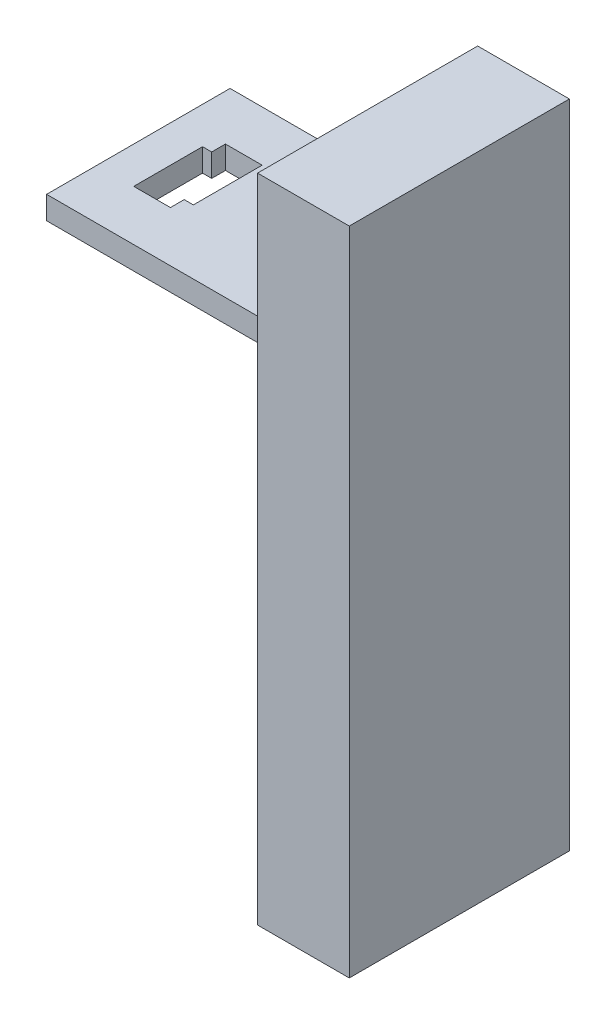
ISO-10303-21;
HEADER;
FILE_DESCRIPTION(('STEP AP214'),'2;1');
FILE_NAME('part.step','',(''),(''),'','','');
FILE_SCHEMA(('AUTOMOTIVE_DESIGN { 1 0 10303 214 1 1 1 1 }'));
ENDSEC;
DATA;
#1=APPLICATION_CONTEXT('core data for automotive mechanical design processes');
#2=APPLICATION_PROTOCOL_DEFINITION('international standard','automotive_design',2000,#1);
#3=PRODUCT_CONTEXT('',#1,'mechanical');
#4=PRODUCT('Part','Part','',(#3));
#5=PRODUCT_RELATED_PRODUCT_CATEGORY('part','',(#4));
#6=PRODUCT_DEFINITION_FORMATION('','',#4);
#7=PRODUCT_DEFINITION_CONTEXT('part definition',#1,'design');
#8=PRODUCT_DEFINITION('design','',#6,#7);
#9=PRODUCT_DEFINITION_SHAPE('','',#8);
#10=(LENGTH_UNIT() NAMED_UNIT(*) SI_UNIT(.MILLI.,.METRE.));
#11=(NAMED_UNIT(*) PLANE_ANGLE_UNIT() SI_UNIT($,.RADIAN.));
#12=(NAMED_UNIT(*) SI_UNIT($,.STERADIAN.) SOLID_ANGLE_UNIT());
#13=UNCERTAINTY_MEASURE_WITH_UNIT(LENGTH_MEASURE(1.E-05),#10,'distance_accuracy_value','');
#14=(GEOMETRIC_REPRESENTATION_CONTEXT(3) GLOBAL_UNCERTAINTY_ASSIGNED_CONTEXT((#13)) GLOBAL_UNIT_ASSIGNED_CONTEXT((#10,
#11,#12)) REPRESENTATION_CONTEXT('',''));
#15=CARTESIAN_POINT('',(0.,0.,0.));
#16=DIRECTION('',(0.,0.,1.));
#17=DIRECTION('',(1.,0.,0.));
#18=AXIS2_PLACEMENT_3D('',#15,#16,#17);
#19=CARTESIAN_POINT('',(0.,0.,0.));
#20=DIRECTION('',(-1.,0.,0.));
#21=DIRECTION('',(0.,0.,1.));
#22=AXIS2_PLACEMENT_3D('',#19,#20,#21);
#23=PLANE('',#22);
#24=DIRECTION('',(0.,0.,-1.));
#25=VECTOR('',#24,1.);
#26=CARTESIAN_POINT('',(0.,79.7999999999999,20.5));
#27=LINE('',#26,#25);
#28=CARTESIAN_POINT('',(0.,79.7999999999999,20.5));
#29=VERTEX_POINT('',#28);
#30=CARTESIAN_POINT('',(0.,79.7999999999999,-20.5));
#31=VERTEX_POINT('',#30);
#32=EDGE_CURVE('E68',#29,#31,#27,.T.);
#33=ORIENTED_EDGE('',*,*,#32,.F.);
#34=DIRECTION('',(0.,1.,0.));
#35=VECTOR('',#34,1.);
#36=CARTESIAN_POINT('',(0.,74.5999999999999,20.5));
#37=LINE('',#36,#35);
#38=CARTESIAN_POINT('',(0.,74.5999999999999,20.5));
#39=VERTEX_POINT('',#38);
#40=EDGE_CURVE('E149',#39,#29,#37,.T.);
#41=ORIENTED_EDGE('',*,*,#40,.F.);
#42=DIRECTION('',(0.,0.,1.));
#43=VECTOR('',#42,1.);
#44=CARTESIAN_POINT('',(0.,74.5999999999999,20.5));
#45=LINE('',#44,#43);
#46=CARTESIAN_POINT('',(0.,74.5999999999999,-20.5));
#47=VERTEX_POINT('',#46);
#48=EDGE_CURVE('E152',#47,#39,#45,.T.);
#49=ORIENTED_EDGE('',*,*,#48,.F.);
#50=DIRECTION('',(0.,-1.,0.));
#51=VECTOR('',#50,1.);
#52=CARTESIAN_POINT('',(0.,74.5999999999999,-20.5));
#53=LINE('',#52,#51);
#54=EDGE_CURVE('E158',#31,#47,#53,.T.);
#55=ORIENTED_EDGE('',*,*,#54,.F.);
#56=EDGE_LOOP('',(#33,#41,#49,#55));
#57=FACE_BOUND('',#56,.T.);
#58=CARTESIAN_POINT('',(0.,14.,-13.));
#59=DIRECTION('',(-1.,0.,0.));
#60=DIRECTION('',(0.,0.,1.));
#61=AXIS2_PLACEMENT_3D('',#58,#59,#60);
#62=CIRCLE('',#61,2.6);
#63=CARTESIAN_POINT('',(0.,14.,-10.4));
#64=VERTEX_POINT('',#63);
#65=EDGE_CURVE('E60',#64,#64,#62,.T.);
#66=ORIENTED_EDGE('',*,*,#65,.F.);
#67=EDGE_LOOP('',(#66));
#68=FACE_BOUND('',#67,.T.);
#69=CARTESIAN_POINT('',(0.,-13.9761892483413,-13.));
#70=DIRECTION('',(-1.,0.,0.));
#71=DIRECTION('',(0.,0.,1.));
#72=AXIS2_PLACEMENT_3D('',#69,#70,#71);
#73=CIRCLE('',#72,2.6);
#74=CARTESIAN_POINT('',(0.,-13.9761892483413,-10.4));
#75=VERTEX_POINT('',#74);
#76=EDGE_CURVE('E201',#75,#75,#73,.T.);
#77=ORIENTED_EDGE('',*,*,#76,.F.);
#78=EDGE_LOOP('',(#77));
#79=FACE_BOUND('',#78,.T.);
#80=CARTESIAN_POINT('',(0.,-13.9761892483413,13.));
#81=DIRECTION('',(-1.,0.,0.));
#82=DIRECTION('',(0.,0.,1.));
#83=AXIS2_PLACEMENT_3D('',#80,#81,#82);
#84=CIRCLE('',#83,2.6);
#85=CARTESIAN_POINT('',(0.,-13.9761892483413,15.6));
#86=VERTEX_POINT('',#85);
#87=EDGE_CURVE('E55',#86,#86,#84,.T.);
#88=ORIENTED_EDGE('',*,*,#87,.F.);
#89=EDGE_LOOP('',(#88));
#90=FACE_BOUND('',#89,.T.);
#91=CARTESIAN_POINT('',(0.,14.,13.));
#92=DIRECTION('',(-1.,0.,0.));
#93=DIRECTION('',(0.,0.,1.));
#94=AXIS2_PLACEMENT_3D('',#91,#92,#93);
#95=CIRCLE('',#94,2.6);
#96=CARTESIAN_POINT('',(0.,14.,15.6));
#97=VERTEX_POINT('',#96);
#98=EDGE_CURVE('E191',#97,#97,#95,.T.);
#99=ORIENTED_EDGE('',*,*,#98,.F.);
#100=EDGE_LOOP('',(#99));
#101=FACE_BOUND('',#100,.T.);
#102=DIRECTION('',(0.,0.,1.));
#103=VECTOR('',#102,1.);
#104=CARTESIAN_POINT('',(0.,110.509514535045,24.0000000000001));
#105=LINE('',#104,#103);
#106=CARTESIAN_POINT('',(0.,110.509514535045,-23.9999999999999));
#107=VERTEX_POINT('',#106);
#108=CARTESIAN_POINT('',(0.,110.509514535045,24.0000000000001));
#109=VERTEX_POINT('',#108);
#110=EDGE_CURVE('E182',#107,#109,#105,.T.);
#111=ORIENTED_EDGE('',*,*,#110,.F.);
#112=DIRECTION('',(0.,1.,0.));
#113=VECTOR('',#112,1.);
#114=CARTESIAN_POINT('',(0.,-31.5,-23.9999999999999));
#115=LINE('',#114,#113);
#116=CARTESIAN_POINT('',(0.,-31.5,-23.9999999999999));
#117=VERTEX_POINT('',#116);
#118=EDGE_CURVE('E105',#117,#107,#115,.T.);
#119=ORIENTED_EDGE('',*,*,#118,.F.);
#120=DIRECTION('',(0.,0.,-1.));
#121=VECTOR('',#120,1.);
#122=CARTESIAN_POINT('',(0.,-31.5,24.0000000000001));
#123=LINE('',#122,#121);
#124=CARTESIAN_POINT('',(0.,-31.5,24.0000000000001));
#125=VERTEX_POINT('',#124);
#126=EDGE_CURVE('E178',#125,#117,#123,.T.);
#127=ORIENTED_EDGE('',*,*,#126,.F.);
#128=DIRECTION('',(0.,-1.,0.));
#129=VECTOR('',#128,1.);
#130=CARTESIAN_POINT('',(0.,-31.5,24.0000000000001));
#131=LINE('',#130,#129);
#132=EDGE_CURVE('E77',#109,#125,#131,.T.);
#133=ORIENTED_EDGE('',*,*,#132,.F.);
#134=EDGE_LOOP('',(#111,#119,#127,#133));
#135=FACE_BOUND('',#134,.T.);
#136=ADVANCED_FACE('F52',(#57,#68,#79,#90,#101,#135),#23,.T.);
#137=CARTESIAN_POINT('',(16.,14.,-13.));
#138=DIRECTION('',(-1.,0.,0.));
#139=DIRECTION('',(0.,0.,1.));
#140=AXIS2_PLACEMENT_3D('',#137,#138,#139);
#141=PLANE('',#140);
#142=CARTESIAN_POINT('',(16.,14.,-13.));
#143=DIRECTION('',(-1.,0.,0.));
#144=DIRECTION('',(0.,0.,1.));
#145=AXIS2_PLACEMENT_3D('',#142,#143,#144);
#146=CIRCLE('',#145,2.6);
#147=CARTESIAN_POINT('',(16.,14.,-10.4));
#148=VERTEX_POINT('',#147);
#149=EDGE_CURVE('E13',#148,#148,#146,.T.);
#150=ORIENTED_EDGE('',*,*,#149,.T.);
#151=EDGE_LOOP('',(#150));
#152=FACE_BOUND('',#151,.T.);
#153=ADVANCED_FACE('F214',(#152),#141,.T.);
#154=CARTESIAN_POINT('',(16.,14.,-13.));
#155=DIRECTION('',(-1.,0.,0.));
#156=DIRECTION('',(0.,0.,1.));
#157=AXIS2_PLACEMENT_3D('',#154,#155,#156);
#158=CYLINDRICAL_SURFACE('',#157,2.6);
#159=ORIENTED_EDGE('',*,*,#149,.F.);
#160=EDGE_LOOP('',(#159));
#161=FACE_BOUND('',#160,.T.);
#162=ORIENTED_EDGE('',*,*,#65,.T.);
#163=EDGE_LOOP('',(#162));
#164=FACE_BOUND('',#163,.T.);
#165=ADVANCED_FACE('F240',(#161,#164),#158,.F.);
#166=CARTESIAN_POINT('',(16.,-13.9761892483413,-13.));
#167=DIRECTION('',(-1.,0.,0.));
#168=DIRECTION('',(0.,0.,1.));
#169=AXIS2_PLACEMENT_3D('',#166,#167,#168);
#170=PLANE('',#169);
#171=CARTESIAN_POINT('',(16.,-13.9761892483413,-13.));
#172=DIRECTION('',(-1.,0.,0.));
#173=DIRECTION('',(0.,0.,1.));
#174=AXIS2_PLACEMENT_3D('',#171,#172,#173);
#175=CIRCLE('',#174,2.6);
#176=CARTESIAN_POINT('',(16.,-13.9761892483413,-10.4));
#177=VERTEX_POINT('',#176);
#178=EDGE_CURVE('E198',#177,#177,#175,.T.);
#179=ORIENTED_EDGE('',*,*,#178,.T.);
#180=EDGE_LOOP('',(#179));
#181=FACE_BOUND('',#180,.T.);
#182=ADVANCED_FACE('F246',(#181),#170,.T.);
#183=CARTESIAN_POINT('',(16.,-13.9761892483413,-13.));
#184=DIRECTION('',(-1.,0.,0.));
#185=DIRECTION('',(0.,0.,1.));
#186=AXIS2_PLACEMENT_3D('',#183,#184,#185);
#187=CYLINDRICAL_SURFACE('',#186,2.6);
#188=ORIENTED_EDGE('',*,*,#178,.F.);
#189=EDGE_LOOP('',(#188));
#190=FACE_BOUND('',#189,.T.);
#191=ORIENTED_EDGE('',*,*,#76,.T.);
#192=EDGE_LOOP('',(#191));
#193=FACE_BOUND('',#192,.T.);
#194=ADVANCED_FACE('F255',(#190,#193),#187,.F.);
#195=CARTESIAN_POINT('',(16.,-13.9761892483413,13.));
#196=DIRECTION('',(-1.,0.,0.));
#197=DIRECTION('',(0.,0.,1.));
#198=AXIS2_PLACEMENT_3D('',#195,#196,#197);
#199=PLANE('',#198);
#200=CARTESIAN_POINT('',(16.,-13.9761892483413,13.));
#201=DIRECTION('',(-1.,0.,0.));
#202=DIRECTION('',(0.,0.,1.));
#203=AXIS2_PLACEMENT_3D('',#200,#201,#202);
#204=CIRCLE('',#203,2.6);
#205=CARTESIAN_POINT('',(16.,-13.9761892483413,15.6));
#206=VERTEX_POINT('',#205);
#207=EDGE_CURVE('E203',#206,#206,#204,.T.);
#208=ORIENTED_EDGE('',*,*,#207,.T.);
#209=EDGE_LOOP('',(#208));
#210=FACE_BOUND('',#209,.T.);
#211=ADVANCED_FACE('F259',(#210),#199,.T.);
#212=CARTESIAN_POINT('',(16.,-13.9761892483413,13.));
#213=DIRECTION('',(-1.,0.,0.));
#214=DIRECTION('',(0.,0.,1.));
#215=AXIS2_PLACEMENT_3D('',#212,#213,#214);
#216=CYLINDRICAL_SURFACE('',#215,2.6);
#217=ORIENTED_EDGE('',*,*,#207,.F.);
#218=EDGE_LOOP('',(#217));
#219=FACE_BOUND('',#218,.T.);
#220=ORIENTED_EDGE('',*,*,#87,.T.);
#221=EDGE_LOOP('',(#220));
#222=FACE_BOUND('',#221,.T.);
#223=ADVANCED_FACE('F210',(#219,#222),#216,.F.);
#224=CARTESIAN_POINT('',(16.,14.,13.));
#225=DIRECTION('',(-1.,0.,0.));
#226=DIRECTION('',(0.,0.,1.));
#227=AXIS2_PLACEMENT_3D('',#224,#225,#226);
#228=PLANE('',#227);
#229=CARTESIAN_POINT('',(16.,14.,13.));
#230=DIRECTION('',(-1.,0.,0.));
#231=DIRECTION('',(0.,0.,1.));
#232=AXIS2_PLACEMENT_3D('',#229,#230,#231);
#233=CIRCLE('',#232,2.6);
#234=CARTESIAN_POINT('',(16.,14.,15.6));
#235=VERTEX_POINT('',#234);
#236=EDGE_CURVE('E185',#235,#235,#233,.T.);
#237=ORIENTED_EDGE('',*,*,#236,.T.);
#238=EDGE_LOOP('',(#237));
#239=FACE_BOUND('',#238,.T.);
#240=ADVANCED_FACE('F250',(#239),#228,.T.);
#241=CARTESIAN_POINT('',(16.,14.,13.));
#242=DIRECTION('',(-1.,0.,0.));
#243=DIRECTION('',(0.,0.,1.));
#244=AXIS2_PLACEMENT_3D('',#241,#242,#243);
#245=CYLINDRICAL_SURFACE('',#244,2.6);
#246=ORIENTED_EDGE('',*,*,#236,.F.);
#247=EDGE_LOOP('',(#246));
#248=FACE_BOUND('',#247,.T.);
#249=ORIENTED_EDGE('',*,*,#98,.T.);
#250=EDGE_LOOP('',(#249));
#251=FACE_BOUND('',#250,.T.);
#252=ADVANCED_FACE('F237',(#248,#251),#245,.F.);
#253=CARTESIAN_POINT('',(20.,110.509514535045,24.0000000000001));
#254=DIRECTION('',(0.,-1.,0.));
#255=DIRECTION('',(0.,0.,-1.));
#256=AXIS2_PLACEMENT_3D('',#253,#254,#255);
#257=PLANE('',#256);
#258=ORIENTED_EDGE('',*,*,#110,.T.);
#259=DIRECTION('',(-1.,0.,0.));
#260=VECTOR('',#259,1.);
#261=CARTESIAN_POINT('',(20.,110.509514535045,24.0000000000001));
#262=LINE('',#261,#260);
#263=CARTESIAN_POINT('',(20.,110.509514535045,24.0000000000001));
#264=VERTEX_POINT('',#263);
#265=EDGE_CURVE('E164',#264,#109,#262,.T.);
#266=ORIENTED_EDGE('',*,*,#265,.F.);
#267=DIRECTION('',(0.,0.,1.));
#268=VECTOR('',#267,1.);
#269=CARTESIAN_POINT('',(20.,110.509514535045,24.0000000000001));
#270=LINE('',#269,#268);
#271=CARTESIAN_POINT('',(20.,110.509514535045,-23.9999999999999));
#272=VERTEX_POINT('',#271);
#273=EDGE_CURVE('E179',#272,#264,#270,.T.);
#274=ORIENTED_EDGE('',*,*,#273,.F.);
#275=DIRECTION('',(-1.,0.,0.));
#276=VECTOR('',#275,1.);
#277=CARTESIAN_POINT('',(20.,110.509514535045,-23.9999999999999));
#278=LINE('',#277,#276);
#279=EDGE_CURVE('E174',#272,#107,#278,.T.);
#280=ORIENTED_EDGE('',*,*,#279,.T.);
#281=EDGE_LOOP('',(#258,#266,#274,#280));
#282=FACE_BOUND('',#281,.T.);
#283=ADVANCED_FACE('F220',(#282),#257,.F.);
#284=CARTESIAN_POINT('',(20.,-31.5,24.0000000000001));
#285=DIRECTION('',(0.,0.,-1.));
#286=DIRECTION('',(-1.,0.,0.));
#287=AXIS2_PLACEMENT_3D('',#284,#285,#286);
#288=PLANE('',#287);
#289=ORIENTED_EDGE('',*,*,#132,.T.);
#290=DIRECTION('',(-1.,0.,0.));
#291=VECTOR('',#290,1.);
#292=CARTESIAN_POINT('',(20.,-31.5,24.0000000000001));
#293=LINE('',#292,#291);
#294=CARTESIAN_POINT('',(20.,-31.5,24.0000000000001));
#295=VERTEX_POINT('',#294);
#296=EDGE_CURVE('E169',#295,#125,#293,.T.);
#297=ORIENTED_EDGE('',*,*,#296,.F.);
#298=DIRECTION('',(0.,-1.,0.));
#299=VECTOR('',#298,1.);
#300=CARTESIAN_POINT('',(20.,-31.5,24.0000000000001));
#301=LINE('',#300,#299);
#302=EDGE_CURVE('E97',#264,#295,#301,.T.);
#303=ORIENTED_EDGE('',*,*,#302,.F.);
#304=ORIENTED_EDGE('',*,*,#265,.T.);
#305=EDGE_LOOP('',(#289,#297,#303,#304));
#306=FACE_BOUND('',#305,.T.);
#307=ADVANCED_FACE('F229',(#306),#288,.F.);
#308=CARTESIAN_POINT('',(20.,-31.5,24.0000000000001));
#309=DIRECTION('',(0.,1.,0.));
#310=DIRECTION('',(0.,0.,1.));
#311=AXIS2_PLACEMENT_3D('',#308,#309,#310);
#312=PLANE('',#311);
#313=ORIENTED_EDGE('',*,*,#126,.T.);
#314=DIRECTION('',(-1.,0.,0.));
#315=VECTOR('',#314,1.);
#316=CARTESIAN_POINT('',(20.,-31.5,-23.9999999999999));
#317=LINE('',#316,#315);
#318=CARTESIAN_POINT('',(20.,-31.5,-23.9999999999999));
#319=VERTEX_POINT('',#318);
#320=EDGE_CURVE('E172',#319,#117,#317,.T.);
#321=ORIENTED_EDGE('',*,*,#320,.F.);
#322=DIRECTION('',(0.,0.,-1.));
#323=VECTOR('',#322,1.);
#324=CARTESIAN_POINT('',(20.,-31.5,24.0000000000001));
#325=LINE('',#324,#323);
#326=EDGE_CURVE('E187',#295,#319,#325,.T.);
#327=ORIENTED_EDGE('',*,*,#326,.F.);
#328=ORIENTED_EDGE('',*,*,#296,.T.);
#329=EDGE_LOOP('',(#313,#321,#327,#328));
#330=FACE_BOUND('',#329,.T.);
#331=ADVANCED_FACE('F228',(#330),#312,.F.);
#332=CARTESIAN_POINT('',(20.,-31.5,-23.9999999999999));
#333=DIRECTION('',(0.,0.,1.));
#334=DIRECTION('',(1.,0.,0.));
#335=AXIS2_PLACEMENT_3D('',#332,#333,#334);
#336=PLANE('',#335);
#337=ORIENTED_EDGE('',*,*,#118,.T.);
#338=ORIENTED_EDGE('',*,*,#279,.F.);
#339=DIRECTION('',(0.,1.,0.));
#340=VECTOR('',#339,1.);
#341=CARTESIAN_POINT('',(20.,-31.5,-23.9999999999999));
#342=LINE('',#341,#340);
#343=EDGE_CURVE('E176',#319,#272,#342,.T.);
#344=ORIENTED_EDGE('',*,*,#343,.F.);
#345=ORIENTED_EDGE('',*,*,#320,.T.);
#346=EDGE_LOOP('',(#337,#338,#344,#345));
#347=FACE_BOUND('',#346,.T.);
#348=ADVANCED_FACE('F223',(#347),#336,.F.);
#349=CARTESIAN_POINT('',(20.,0.,0.));
#350=DIRECTION('',(1.,0.,0.));
#351=DIRECTION('',(0.,0.,-1.));
#352=AXIS2_PLACEMENT_3D('',#349,#350,#351);
#353=PLANE('',#352);
#354=ORIENTED_EDGE('',*,*,#273,.T.);
#355=ORIENTED_EDGE('',*,*,#302,.T.);
#356=ORIENTED_EDGE('',*,*,#326,.T.);
#357=ORIENTED_EDGE('',*,*,#343,.T.);
#358=EDGE_LOOP('',(#354,#355,#356,#357));
#359=FACE_BOUND('',#358,.T.);
#360=ADVANCED_FACE('F216',(#359),#353,.T.);
#361=CARTESIAN_POINT('',(2.,79.7999999999999,20.5));
#362=DIRECTION('',(0.,1.,0.));
#363=DIRECTION('',(0.,0.,1.));
#364=AXIS2_PLACEMENT_3D('',#361,#362,#363);
#365=PLANE('',#364);
#366=ORIENTED_EDGE('',*,*,#32,.T.);
#367=DIRECTION('',(-1.,0.,0.));
#368=VECTOR('',#367,1.);
#369=CARTESIAN_POINT('',(2.,79.7999999999999,-20.5));
#370=LINE('',#369,#368);
#371=CARTESIAN_POINT('',(2.,79.7999999999999,-20.5));
#372=VERTEX_POINT('',#371);
#373=EDGE_CURVE('E127',#372,#31,#370,.T.);
#374=ORIENTED_EDGE('',*,*,#373,.F.);
#375=DIRECTION('',(0.,0.,-1.));
#376=VECTOR('',#375,1.);
#377=CARTESIAN_POINT('',(2.,79.7999999999999,20.5));
#378=LINE('',#377,#376);
#379=CARTESIAN_POINT('',(2.,79.7999999999999,20.5));
#380=VERTEX_POINT('',#379);
#381=EDGE_CURVE('E131',#380,#372,#378,.T.);
#382=ORIENTED_EDGE('',*,*,#381,.F.);
#383=DIRECTION('',(-1.,0.,0.));
#384=VECTOR('',#383,1.);
#385=CARTESIAN_POINT('',(2.,79.7999999999999,20.5));
#386=LINE('',#385,#384);
#387=EDGE_CURVE('E162',#380,#29,#386,.T.);
#388=ORIENTED_EDGE('',*,*,#387,.T.);
#389=EDGE_LOOP('',(#366,#374,#382,#388));
#390=FACE_BOUND('',#389,.T.);
#391=ADVANCED_FACE('F129',(#390),#365,.F.);
#392=CARTESIAN_POINT('',(2.,74.5999999999999,20.5));
#393=DIRECTION('',(0.,0.,1.));
#394=DIRECTION('',(1.,0.,0.));
#395=AXIS2_PLACEMENT_3D('',#392,#393,#394);
#396=PLANE('',#395);
#397=ORIENTED_EDGE('',*,*,#40,.T.);
#398=ORIENTED_EDGE('',*,*,#387,.F.);
#399=DIRECTION('',(0.,1.,0.));
#400=VECTOR('',#399,1.);
#401=CARTESIAN_POINT('',(2.,74.5999999999999,20.5));
#402=LINE('',#401,#400);
#403=CARTESIAN_POINT('',(2.,74.5999999999999,20.5));
#404=VERTEX_POINT('',#403);
#405=EDGE_CURVE('E137',#404,#380,#402,.T.);
#406=ORIENTED_EDGE('',*,*,#405,.F.);
#407=DIRECTION('',(-1.,0.,0.));
#408=VECTOR('',#407,1.);
#409=CARTESIAN_POINT('',(2.,74.5999999999999,20.5));
#410=LINE('',#409,#408);
#411=EDGE_CURVE('E165',#404,#39,#410,.T.);
#412=ORIENTED_EDGE('',*,*,#411,.T.);
#413=EDGE_LOOP('',(#397,#398,#406,#412));
#414=FACE_BOUND('',#413,.T.);
#415=ADVANCED_FACE('F299',(#414),#396,.F.);
#416=CARTESIAN_POINT('',(2.,74.5999999999999,20.5));
#417=DIRECTION('',(0.,-1.,0.));
#418=DIRECTION('',(0.,0.,-1.));
#419=AXIS2_PLACEMENT_3D('',#416,#417,#418);
#420=PLANE('',#419);
#421=ORIENTED_EDGE('',*,*,#48,.T.);
#422=ORIENTED_EDGE('',*,*,#411,.F.);
#423=DIRECTION('',(0.,0.,1.));
#424=VECTOR('',#423,1.);
#425=CARTESIAN_POINT('',(2.,74.5999999999999,20.5));
#426=LINE('',#425,#424);
#427=CARTESIAN_POINT('',(2.,74.5999999999999,-20.5));
#428=VERTEX_POINT('',#427);
#429=EDGE_CURVE('E145',#428,#404,#426,.T.);
#430=ORIENTED_EDGE('',*,*,#429,.F.);
#431=DIRECTION('',(-1.,0.,0.));
#432=VECTOR('',#431,1.);
#433=CARTESIAN_POINT('',(2.,74.5999999999999,-20.5));
#434=LINE('',#433,#432);
#435=EDGE_CURVE('E136',#428,#47,#434,.T.);
#436=ORIENTED_EDGE('',*,*,#435,.T.);
#437=EDGE_LOOP('',(#421,#422,#430,#436));
#438=FACE_BOUND('',#437,.T.);
#439=ADVANCED_FACE('F306',(#438),#420,.F.);
#440=CARTESIAN_POINT('',(2.,74.5999999999999,-20.5));
#441=DIRECTION('',(0.,0.,-1.));
#442=DIRECTION('',(-1.,0.,0.));
#443=AXIS2_PLACEMENT_3D('',#440,#441,#442);
#444=PLANE('',#443);
#445=ORIENTED_EDGE('',*,*,#54,.T.);
#446=ORIENTED_EDGE('',*,*,#435,.F.);
#447=DIRECTION('',(0.,-1.,0.));
#448=VECTOR('',#447,1.);
#449=CARTESIAN_POINT('',(2.,74.5999999999999,-20.5));
#450=LINE('',#449,#448);
#451=EDGE_CURVE('E140',#372,#428,#450,.T.);
#452=ORIENTED_EDGE('',*,*,#451,.F.);
#453=ORIENTED_EDGE('',*,*,#373,.T.);
#454=EDGE_LOOP('',(#445,#446,#452,#453));
#455=FACE_BOUND('',#454,.T.);
#456=ADVANCED_FACE('F141',(#455),#444,.F.);
#457=CARTESIAN_POINT('',(2.,0.,0.));
#458=DIRECTION('',(1.,0.,0.));
#459=DIRECTION('',(0.,0.,-1.));
#460=AXIS2_PLACEMENT_3D('',#457,#458,#459);
#461=PLANE('',#460);
#462=ORIENTED_EDGE('',*,*,#381,.T.);
#463=ORIENTED_EDGE('',*,*,#451,.T.);
#464=ORIENTED_EDGE('',*,*,#429,.T.);
#465=ORIENTED_EDGE('',*,*,#405,.T.);
#466=EDGE_LOOP('',(#462,#463,#464,#465));
#467=FACE_BOUND('',#466,.T.);
#468=ADVANCED_FACE('F147',(#467),#461,.F.);
#469=CLOSED_SHELL('',(#136,#153,#165,#182,#194,#211,#223,#240,#252,#283,#307,#331,#348,#360,
#391,#415,#439,#456,#468));
#470=MANIFOLD_SOLID_BREP('B2',#469);
#471=CARTESIAN_POINT('',(0.,0.,0.));
#472=DIRECTION('',(-1.,0.,0.));
#473=DIRECTION('',(0.,0.,1.));
#474=AXIS2_PLACEMENT_3D('',#471,#472,#473);
#475=PLANE('',#474);
#476=DIRECTION('',(0.,0.,1.));
#477=VECTOR('',#476,1.);
#478=CARTESIAN_POINT('',(0.,79.5000000000002,0.));
#479=LINE('',#478,#477);
#480=CARTESIAN_POINT('',(0.,79.5000000000002,-20.));
#481=VERTEX_POINT('',#480);
#482=CARTESIAN_POINT('',(0.,79.5000000000002,20.));
#483=VERTEX_POINT('',#482);
#484=EDGE_CURVE('E417',#481,#483,#479,.T.);
#485=ORIENTED_EDGE('',*,*,#484,.T.);
#486=DIRECTION('',(0.,-1.,0.));
#487=VECTOR('',#486,1.);
#488=CARTESIAN_POINT('',(0.,0.,20.));
#489=LINE('',#488,#487);
#490=CARTESIAN_POINT('',(0.,74.5000000000002,20.));
#491=VERTEX_POINT('',#490);
#492=EDGE_CURVE('E582',#483,#491,#489,.T.);
#493=ORIENTED_EDGE('',*,*,#492,.T.);
#494=DIRECTION('',(0.,0.,-1.));
#495=VECTOR('',#494,1.);
#496=CARTESIAN_POINT('',(0.,74.5000000000002,0.));
#497=LINE('',#496,#495);
#498=CARTESIAN_POINT('',(0.,74.5000000000002,-20.));
#499=VERTEX_POINT('',#498);
#500=EDGE_CURVE('E422',#491,#499,#497,.T.);
#501=ORIENTED_EDGE('',*,*,#500,.T.);
#502=DIRECTION('',(0.,1.,0.));
#503=VECTOR('',#502,1.);
#504=CARTESIAN_POINT('',(0.,0.,-20.));
#505=LINE('',#504,#503);
#506=EDGE_CURVE('E50',#499,#481,#505,.T.);
#507=ORIENTED_EDGE('',*,*,#506,.T.);
#508=EDGE_LOOP('',(#485,#493,#501,#507));
#509=FACE_BOUND('',#508,.T.);
#510=ADVANCED_FACE('F414',(#509),#475,.F.);
#511=CARTESIAN_POINT('',(2.,74.5000000000002,20.));
#512=DIRECTION('',(0.,0.,1.));
#513=DIRECTION('',(1.,0.,0.));
#514=AXIS2_PLACEMENT_3D('',#511,#512,#513);
#515=PLANE('',#514);
#516=ORIENTED_EDGE('',*,*,#492,.F.);
#517=DIRECTION('',(-1.,0.,0.));
#518=VECTOR('',#517,1.);
#519=CARTESIAN_POINT('',(2.,79.5000000000002,20.));
#520=LINE('',#519,#518);
#521=CARTESIAN_POINT('',(-50.,79.5000000000002,20.));
#522=VERTEX_POINT('',#521);
#523=EDGE_CURVE('E575',#483,#522,#520,.T.);
#524=ORIENTED_EDGE('',*,*,#523,.T.);
#525=DIRECTION('',(0.,1.,0.));
#526=VECTOR('',#525,1.);
#527=CARTESIAN_POINT('',(-50.,74.5000000000002,20.));
#528=LINE('',#527,#526);
#529=CARTESIAN_POINT('',(-50.,74.5000000000002,20.));
#530=VERTEX_POINT('',#529);
#531=EDGE_CURVE('E571',#530,#522,#528,.T.);
#532=ORIENTED_EDGE('',*,*,#531,.F.);
#533=DIRECTION('',(-1.,0.,0.));
#534=VECTOR('',#533,1.);
#535=CARTESIAN_POINT('',(2.,74.5000000000002,20.));
#536=LINE('',#535,#534);
#537=EDGE_CURVE('E577',#491,#530,#536,.T.);
#538=ORIENTED_EDGE('',*,*,#537,.F.);
#539=EDGE_LOOP('',(#516,#524,#532,#538));
#540=FACE_BOUND('',#539,.T.);
#541=ADVANCED_FACE('F593',(#540),#515,.T.);
#542=CARTESIAN_POINT('',(-33.9999999999998,53.9087397180042,-1.11022302462516E-13));
#543=DIRECTION('',(1.,0.,0.));
#544=DIRECTION('',(0.,0.,-1.));
#545=AXIS2_PLACEMENT_3D('',#542,#543,#544);
#546=PLANE('',#545);
#547=DIRECTION('',(0.,1.,0.));
#548=VECTOR('',#547,1.);
#549=CARTESIAN_POINT('',(-33.9999999999998,53.9087397180042,9.00000000000012));
#550=LINE('',#549,#548);
#551=CARTESIAN_POINT('',(-33.9999999999998,74.5000000000002,9.00000000000012));
#552=VERTEX_POINT('',#551);
#553=CARTESIAN_POINT('',(-33.9999999999998,79.5000000000002,9.00000000000012));
#554=VERTEX_POINT('',#553);
#555=EDGE_CURVE('E551',#552,#554,#550,.T.);
#556=ORIENTED_EDGE('',*,*,#555,.T.);
#557=DIRECTION('',(0.,0.,-1.));
#558=VECTOR('',#557,1.);
#559=CARTESIAN_POINT('',(-33.9999999999998,79.5000000000002,-1.11022302462516E-13));
#560=LINE('',#559,#558);
#561=CARTESIAN_POINT('',(-33.9999999999998,79.5000000000002,6.00000000000012));
#562=VERTEX_POINT('',#561);
#563=EDGE_CURVE('E531',#554,#562,#560,.T.);
#564=ORIENTED_EDGE('',*,*,#563,.T.);
#565=DIRECTION('',(0.,1.,0.));
#566=VECTOR('',#565,1.);
#567=CARTESIAN_POINT('',(-33.9999999999998,53.9087397180042,6.00000000000012));
#568=LINE('',#567,#566);
#569=CARTESIAN_POINT('',(-33.9999999999998,74.5000000000002,6.00000000000012));
#570=VERTEX_POINT('',#569);
#571=EDGE_CURVE('E534',#570,#562,#568,.T.);
#572=ORIENTED_EDGE('',*,*,#571,.F.);
#573=DIRECTION('',(0.,0.,-1.));
#574=VECTOR('',#573,1.);
#575=CARTESIAN_POINT('',(-33.9999999999998,74.5000000000002,-1.11022302462516E-13));
#576=LINE('',#575,#574);
#577=EDGE_CURVE('E523',#552,#570,#576,.T.);
#578=ORIENTED_EDGE('',*,*,#577,.F.);
#579=EDGE_LOOP('',(#556,#564,#572,#578));
#580=FACE_BOUND('',#579,.T.);
#581=ADVANCED_FACE('F610',(#580),#546,.F.);
#582=CARTESIAN_POINT('',(0.,53.9087397180042,9.00000000000012));
#583=DIRECTION('',(0.,0.,-1.));
#584=DIRECTION('',(-1.,0.,0.));
#585=AXIS2_PLACEMENT_3D('',#582,#583,#584);
#586=PLANE('',#585);
#587=DIRECTION('',(-1.,0.,0.));
#588=VECTOR('',#587,1.);
#589=CARTESIAN_POINT('',(0.,74.5000000000002,9.00000000000012));
#590=LINE('',#589,#588);
#591=CARTESIAN_POINT('',(-41.9999999999998,74.5000000000002,9.00000000000012));
#592=VERTEX_POINT('',#591);
#593=EDGE_CURVE('E536',#552,#592,#590,.T.);
#594=ORIENTED_EDGE('',*,*,#593,.T.);
#595=DIRECTION('',(0.,1.,0.));
#596=VECTOR('',#595,1.);
#597=CARTESIAN_POINT('',(-41.9999999999998,53.9087397180042,9.00000000000012));
#598=LINE('',#597,#596);
#599=CARTESIAN_POINT('',(-41.9999999999998,79.5000000000002,9.00000000000012));
#600=VERTEX_POINT('',#599);
#601=EDGE_CURVE('E555',#592,#600,#598,.T.);
#602=ORIENTED_EDGE('',*,*,#601,.T.);
#603=DIRECTION('',(-1.,0.,0.));
#604=VECTOR('',#603,1.);
#605=CARTESIAN_POINT('',(0.,79.5000000000002,9.00000000000012));
#606=LINE('',#605,#604);
#607=EDGE_CURVE('E535',#554,#600,#606,.T.);
#608=ORIENTED_EDGE('',*,*,#607,.F.);
#609=ORIENTED_EDGE('',*,*,#555,.F.);
#610=EDGE_LOOP('',(#594,#602,#608,#609));
#611=FACE_BOUND('',#610,.T.);
#612=ADVANCED_FACE('F616',(#611),#586,.T.);
#613=CARTESIAN_POINT('',(-41.9999999999998,53.9087397180042,0.));
#614=DIRECTION('',(1.,0.,0.));
#615=DIRECTION('',(0.,0.,-1.));
#616=AXIS2_PLACEMENT_3D('',#613,#614,#615);
#617=PLANE('',#616);
#618=DIRECTION('',(0.,0.,-1.));
#619=VECTOR('',#618,1.);
#620=CARTESIAN_POINT('',(-41.9999999999998,74.5000000000002,0.));
#621=LINE('',#620,#619);
#622=CARTESIAN_POINT('',(-42.,74.5000000000002,-5.99999999999986));
#623=VERTEX_POINT('',#622);
#624=EDGE_CURVE('E538',#592,#623,#621,.T.);
#625=ORIENTED_EDGE('',*,*,#624,.T.);
#626=DIRECTION('',(0.,1.,0.));
#627=VECTOR('',#626,1.);
#628=CARTESIAN_POINT('',(-42.,53.9087397180042,-5.99999999999989));
#629=LINE('',#628,#627);
#630=CARTESIAN_POINT('',(-42.,79.5000000000002,-5.99999999999989));
#631=VERTEX_POINT('',#630);
#632=EDGE_CURVE('E543',#623,#631,#629,.T.);
#633=ORIENTED_EDGE('',*,*,#632,.T.);
#634=DIRECTION('',(0.,0.,-1.));
#635=VECTOR('',#634,1.);
#636=CARTESIAN_POINT('',(-41.9999999999998,79.5000000000002,0.));
#637=LINE('',#636,#635);
#638=EDGE_CURVE('E554',#600,#631,#637,.T.);
#639=ORIENTED_EDGE('',*,*,#638,.F.);
#640=ORIENTED_EDGE('',*,*,#601,.F.);
#641=EDGE_LOOP('',(#625,#633,#639,#640));
#642=FACE_BOUND('',#641,.T.);
#643=ADVANCED_FACE('F637',(#642),#617,.T.);
#644=CARTESIAN_POINT('',(0.,53.9087397180042,-6.00000000000001));
#645=DIRECTION('',(0.,0.,-1.));
#646=DIRECTION('',(-1.,0.,0.));
#647=AXIS2_PLACEMENT_3D('',#644,#645,#646);
#648=PLANE('',#647);
#649=DIRECTION('',(0.,1.,0.));
#650=VECTOR('',#649,1.);
#651=CARTESIAN_POINT('',(-40.,53.9087397180042,-6.00000000002499));
#652=LINE('',#651,#650);
#653=CARTESIAN_POINT('',(-40.,74.5000000000002,-6.00000000002499));
#654=VERTEX_POINT('',#653);
#655=CARTESIAN_POINT('',(-40.,79.5000000000002,-6.00000000002499));
#656=VERTEX_POINT('',#655);
#657=EDGE_CURVE('E544',#654,#656,#652,.T.);
#658=ORIENTED_EDGE('',*,*,#657,.T.);
#659=DIRECTION('',(-1.,0.,0.));
#660=VECTOR('',#659,1.);
#661=CARTESIAN_POINT('',(0.,79.5000000000002,-6.00000000000001));
#662=LINE('',#661,#660);
#663=EDGE_CURVE('E524',#656,#631,#662,.T.);
#664=ORIENTED_EDGE('',*,*,#663,.T.);
#665=ORIENTED_EDGE('',*,*,#632,.F.);
#666=DIRECTION('',(-1.,0.,0.));
#667=VECTOR('',#666,1.);
#668=CARTESIAN_POINT('',(0.,74.5000000000002,-6.00000000000001));
#669=LINE('',#668,#667);
#670=EDGE_CURVE('E540',#654,#623,#669,.T.);
#671=ORIENTED_EDGE('',*,*,#670,.F.);
#672=EDGE_LOOP('',(#658,#664,#665,#671));
#673=FACE_BOUND('',#672,.T.);
#674=ADVANCED_FACE('F633',(#673),#648,.F.);
#675=CARTESIAN_POINT('',(-40.,53.9087397180042,-2.50910403565285E-11));
#676=DIRECTION('',(-1.,0.,0.));
#677=DIRECTION('',(0.,0.,1.));
#678=AXIS2_PLACEMENT_3D('',#675,#676,#677);
#679=PLANE('',#678);
#680=DIRECTION('',(0.,1.,0.));
#681=VECTOR('',#680,1.);
#682=CARTESIAN_POINT('',(-40.,53.9087397180042,-9.00000000002488));
#683=LINE('',#682,#681);
#684=CARTESIAN_POINT('',(-40.,74.5000000000002,-8.9999999999999));
#685=VERTEX_POINT('',#684);
#686=CARTESIAN_POINT('',(-40.,79.5000000000002,-9.00000000002488));
#687=VERTEX_POINT('',#686);
#688=EDGE_CURVE('E548',#685,#687,#683,.T.);
#689=ORIENTED_EDGE('',*,*,#688,.T.);
#690=DIRECTION('',(0.,0.,1.));
#691=VECTOR('',#690,1.);
#692=CARTESIAN_POINT('',(-40.,79.5000000000002,-2.50910403565285E-11));
#693=LINE('',#692,#691);
#694=EDGE_CURVE('E527',#687,#656,#693,.T.);
#695=ORIENTED_EDGE('',*,*,#694,.T.);
#696=ORIENTED_EDGE('',*,*,#657,.F.);
#697=DIRECTION('',(0.,0.,1.));
#698=VECTOR('',#697,1.);
#699=CARTESIAN_POINT('',(-40.,74.5000000000002,-2.50910403565285E-11));
#700=LINE('',#699,#698);
#701=EDGE_CURVE('E545',#685,#654,#700,.T.);
#702=ORIENTED_EDGE('',*,*,#701,.F.);
#703=EDGE_LOOP('',(#689,#695,#696,#702));
#704=FACE_BOUND('',#703,.T.);
#705=ADVANCED_FACE('F629',(#704),#679,.F.);
#706=CARTESIAN_POINT('',(0.,53.9087397180042,-8.9999999999999));
#707=DIRECTION('',(0.,0.,-1.));
#708=DIRECTION('',(-1.,0.,0.));
#709=AXIS2_PLACEMENT_3D('',#706,#707,#708);
#710=PLANE('',#709);
#711=DIRECTION('',(0.,1.,0.));
#712=VECTOR('',#711,1.);
#713=CARTESIAN_POINT('',(-32.,53.9087397180042,-8.9999999999999));
#714=LINE('',#713,#712);
#715=CARTESIAN_POINT('',(-32.,74.5000000000002,-8.9999999999999));
#716=VERTEX_POINT('',#715);
#717=CARTESIAN_POINT('',(-32.,79.5000000000002,-8.9999999999999));
#718=VERTEX_POINT('',#717);
#719=EDGE_CURVE('E507',#716,#718,#714,.T.);
#720=ORIENTED_EDGE('',*,*,#719,.T.);
#721=DIRECTION('',(-1.,0.,0.));
#722=VECTOR('',#721,1.);
#723=CARTESIAN_POINT('',(0.,79.5000000000002,-8.9999999999999));
#724=LINE('',#723,#722);
#725=EDGE_CURVE('E661',#718,#687,#724,.T.);
#726=ORIENTED_EDGE('',*,*,#725,.T.);
#727=ORIENTED_EDGE('',*,*,#688,.F.);
#728=DIRECTION('',(-1.,0.,0.));
#729=VECTOR('',#728,1.);
#730=CARTESIAN_POINT('',(0.,74.5000000000002,-8.9999999999999));
#731=LINE('',#730,#729);
#732=EDGE_CURVE('E549',#716,#685,#731,.T.);
#733=ORIENTED_EDGE('',*,*,#732,.F.);
#734=EDGE_LOOP('',(#720,#726,#727,#733));
#735=FACE_BOUND('',#734,.T.);
#736=ADVANCED_FACE('F626',(#735),#710,.F.);
#737=CARTESIAN_POINT('',(-32.,53.9087397180042,0.));
#738=DIRECTION('',(1.,0.,0.));
#739=DIRECTION('',(0.,0.,-1.));
#740=AXIS2_PLACEMENT_3D('',#737,#738,#739);
#741=PLANE('',#740);
#742=DIRECTION('',(0.,1.,0.));
#743=VECTOR('',#742,1.);
#744=CARTESIAN_POINT('',(-31.9999999999998,53.9087397180042,6.00000000000012));
#745=LINE('',#744,#743);
#746=CARTESIAN_POINT('',(-31.9999999999998,74.5000000000002,6.00000000000012));
#747=VERTEX_POINT('',#746);
#748=CARTESIAN_POINT('',(-31.9999999999998,79.5000000000002,6.00000000000012));
#749=VERTEX_POINT('',#748);
#750=EDGE_CURVE('E505',#747,#749,#745,.T.);
#751=ORIENTED_EDGE('',*,*,#750,.T.);
#752=DIRECTION('',(0.,0.,-1.));
#753=VECTOR('',#752,1.);
#754=CARTESIAN_POINT('',(-32.,79.5000000000002,0.));
#755=LINE('',#754,#753);
#756=EDGE_CURVE('E668',#749,#718,#755,.T.);
#757=ORIENTED_EDGE('',*,*,#756,.T.);
#758=ORIENTED_EDGE('',*,*,#719,.F.);
#759=DIRECTION('',(0.,0.,-1.));
#760=VECTOR('',#759,1.);
#761=CARTESIAN_POINT('',(-32.,74.5000000000002,0.));
#762=LINE('',#761,#760);
#763=EDGE_CURVE('E501',#747,#716,#762,.T.);
#764=ORIENTED_EDGE('',*,*,#763,.F.);
#765=EDGE_LOOP('',(#751,#757,#758,#764));
#766=FACE_BOUND('',#765,.T.);
#767=ADVANCED_FACE('F503',(#766),#741,.F.);
#768=CARTESIAN_POINT('',(0.,53.9087397180042,6.00000000000023));
#769=DIRECTION('',(0.,0.,1.));
#770=DIRECTION('',(1.,0.,0.));
#771=AXIS2_PLACEMENT_3D('',#768,#769,#770);
#772=PLANE('',#771);
#773=ORIENTED_EDGE('',*,*,#571,.T.);
#774=DIRECTION('',(1.,0.,0.));
#775=VECTOR('',#774,1.);
#776=CARTESIAN_POINT('',(0.,79.5000000000002,6.00000000000023));
#777=LINE('',#776,#775);
#778=EDGE_CURVE('E518',#562,#749,#777,.T.);
#779=ORIENTED_EDGE('',*,*,#778,.T.);
#780=ORIENTED_EDGE('',*,*,#750,.F.);
#781=DIRECTION('',(1.,0.,0.));
#782=VECTOR('',#781,1.);
#783=CARTESIAN_POINT('',(0.,74.5000000000002,6.00000000000023));
#784=LINE('',#783,#782);
#785=EDGE_CURVE('E515',#570,#747,#784,.T.);
#786=ORIENTED_EDGE('',*,*,#785,.F.);
#787=EDGE_LOOP('',(#773,#779,#780,#786));
#788=FACE_BOUND('',#787,.T.);
#789=ADVANCED_FACE('F514',(#788),#772,.F.);
#790=CARTESIAN_POINT('',(2.,79.5000000000002,20.));
#791=DIRECTION('',(0.,1.,0.));
#792=DIRECTION('',(0.,0.,1.));
#793=AXIS2_PLACEMENT_3D('',#790,#791,#792);
#794=PLANE('',#793);
#795=ORIENTED_EDGE('',*,*,#778,.F.);
#796=ORIENTED_EDGE('',*,*,#563,.F.);
#797=ORIENTED_EDGE('',*,*,#607,.T.);
#798=ORIENTED_EDGE('',*,*,#638,.T.);
#799=ORIENTED_EDGE('',*,*,#663,.F.);
#800=ORIENTED_EDGE('',*,*,#694,.F.);
#801=ORIENTED_EDGE('',*,*,#725,.F.);
#802=ORIENTED_EDGE('',*,*,#756,.F.);
#803=EDGE_LOOP('',(#795,#796,#797,#798,#799,#800,#801,#802));
#804=FACE_BOUND('',#803,.T.);
#805=ORIENTED_EDGE('',*,*,#484,.F.);
#806=DIRECTION('',(-1.,0.,0.));
#807=VECTOR('',#806,1.);
#808=CARTESIAN_POINT('',(2.,79.5000000000002,-20.));
#809=LINE('',#808,#807);
#810=CARTESIAN_POINT('',(-50.,79.5000000000002,-20.));
#811=VERTEX_POINT('',#810);
#812=EDGE_CURVE('E574',#481,#811,#809,.T.);
#813=ORIENTED_EDGE('',*,*,#812,.T.);
#814=DIRECTION('',(0.,0.,-1.));
#815=VECTOR('',#814,1.);
#816=CARTESIAN_POINT('',(-50.,79.5000000000002,20.));
#817=LINE('',#816,#815);
#818=EDGE_CURVE('E562',#522,#811,#817,.T.);
#819=ORIENTED_EDGE('',*,*,#818,.F.);
#820=ORIENTED_EDGE('',*,*,#523,.F.);
#821=EDGE_LOOP('',(#805,#813,#819,#820));
#822=FACE_BOUND('',#821,.T.);
#823=ADVANCED_FACE('F590',(#804,#822),#794,.T.);
#824=CARTESIAN_POINT('',(-50.,0.,0.));
#825=DIRECTION('',(1.,0.,0.));
#826=DIRECTION('',(0.,0.,-1.));
#827=AXIS2_PLACEMENT_3D('',#824,#825,#826);
#828=PLANE('',#827);
#829=ORIENTED_EDGE('',*,*,#818,.T.);
#830=DIRECTION('',(0.,-1.,0.));
#831=VECTOR('',#830,1.);
#832=CARTESIAN_POINT('',(-50.,74.5000000000002,-20.));
#833=LINE('',#832,#831);
#834=CARTESIAN_POINT('',(-50.,74.5000000000002,-20.));
#835=VERTEX_POINT('',#834);
#836=EDGE_CURVE('E565',#811,#835,#833,.T.);
#837=ORIENTED_EDGE('',*,*,#836,.T.);
#838=DIRECTION('',(0.,0.,1.));
#839=VECTOR('',#838,1.);
#840=CARTESIAN_POINT('',(-50.,74.5000000000002,20.));
#841=LINE('',#840,#839);
#842=EDGE_CURVE('E568',#835,#530,#841,.T.);
#843=ORIENTED_EDGE('',*,*,#842,.T.);
#844=ORIENTED_EDGE('',*,*,#531,.T.);
#845=EDGE_LOOP('',(#829,#837,#843,#844));
#846=FACE_BOUND('',#845,.T.);
#847=ADVANCED_FACE('F595',(#846),#828,.F.);
#848=CARTESIAN_POINT('',(2.,74.5000000000002,20.));
#849=DIRECTION('',(0.,-1.,0.));
#850=DIRECTION('',(0.,0.,-1.));
#851=AXIS2_PLACEMENT_3D('',#848,#849,#850);
#852=PLANE('',#851);
#853=ORIENTED_EDGE('',*,*,#785,.T.);
#854=ORIENTED_EDGE('',*,*,#763,.T.);
#855=ORIENTED_EDGE('',*,*,#732,.T.);
#856=ORIENTED_EDGE('',*,*,#701,.T.);
#857=ORIENTED_EDGE('',*,*,#670,.T.);
#858=ORIENTED_EDGE('',*,*,#624,.F.);
#859=ORIENTED_EDGE('',*,*,#593,.F.);
#860=ORIENTED_EDGE('',*,*,#577,.T.);
#861=EDGE_LOOP('',(#853,#854,#855,#856,#857,#858,#859,#860));
#862=FACE_BOUND('',#861,.T.);
#863=ORIENTED_EDGE('',*,*,#500,.F.);
#864=ORIENTED_EDGE('',*,*,#537,.T.);
#865=ORIENTED_EDGE('',*,*,#842,.F.);
#866=DIRECTION('',(-1.,0.,0.));
#867=VECTOR('',#866,1.);
#868=CARTESIAN_POINT('',(2.,74.5000000000002,-20.));
#869=LINE('',#868,#867);
#870=EDGE_CURVE('E579',#499,#835,#869,.T.);
#871=ORIENTED_EDGE('',*,*,#870,.F.);
#872=EDGE_LOOP('',(#863,#864,#865,#871));
#873=FACE_BOUND('',#872,.T.);
#874=ADVANCED_FACE('F521',(#862,#873),#852,.T.);
#875=CARTESIAN_POINT('',(2.,74.5000000000002,-20.));
#876=DIRECTION('',(0.,0.,-1.));
#877=DIRECTION('',(-1.,0.,0.));
#878=AXIS2_PLACEMENT_3D('',#875,#876,#877);
#879=PLANE('',#878);
#880=ORIENTED_EDGE('',*,*,#506,.F.);
#881=ORIENTED_EDGE('',*,*,#870,.T.);
#882=ORIENTED_EDGE('',*,*,#836,.F.);
#883=ORIENTED_EDGE('',*,*,#812,.F.);
#884=EDGE_LOOP('',(#880,#881,#882,#883));
#885=FACE_BOUND('',#884,.T.);
#886=ADVANCED_FACE('F598',(#885),#879,.T.);
#887=CLOSED_SHELL('',(#510,#541,#581,#612,#643,#674,#705,#736,#767,#789,#823,#847,#874,#886));
#888=MANIFOLD_SOLID_BREP('B7',#887);
#889=ADVANCED_BREP_SHAPE_REPRESENTATION('',(#18,#470,#888),#14);
#890=SHAPE_DEFINITION_REPRESENTATION(#9,#889);
ENDSEC;
END-ISO-10303-21;
